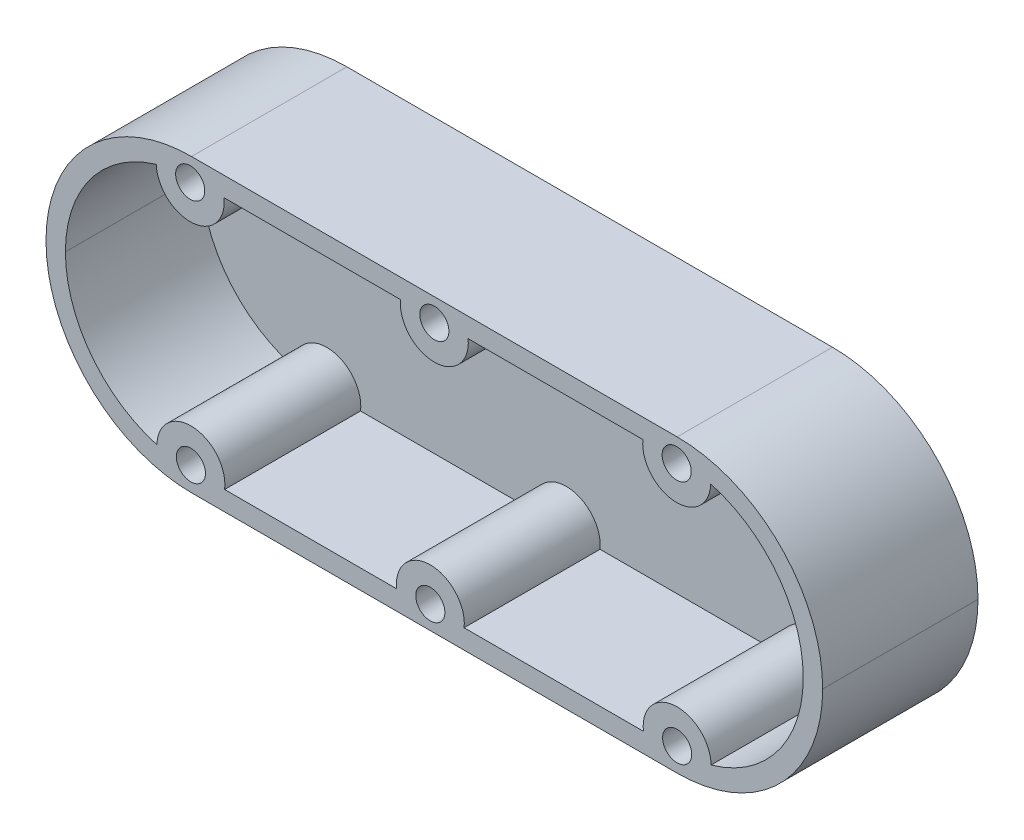
ISO-10303-21;
HEADER;
FILE_DESCRIPTION(('STEP AP214'),'2;1');
FILE_NAME('part.step','',(''),(''),'','','');
FILE_SCHEMA(('AUTOMOTIVE_DESIGN { 1 0 10303 214 1 1 1 1 }'));
ENDSEC;
DATA;
#1=APPLICATION_CONTEXT('core data for automotive mechanical design processes');
#2=APPLICATION_PROTOCOL_DEFINITION('international standard','automotive_design',2000,#1);
#3=PRODUCT_CONTEXT('',#1,'mechanical');
#4=PRODUCT('Part','Part','',(#3));
#5=PRODUCT_RELATED_PRODUCT_CATEGORY('part','',(#4));
#6=PRODUCT_DEFINITION_FORMATION('','',#4);
#7=PRODUCT_DEFINITION_CONTEXT('part definition',#1,'design');
#8=PRODUCT_DEFINITION('design','',#6,#7);
#9=PRODUCT_DEFINITION_SHAPE('','',#8);
#10=(LENGTH_UNIT() NAMED_UNIT(*) SI_UNIT(.MILLI.,.METRE.));
#11=(NAMED_UNIT(*) PLANE_ANGLE_UNIT() SI_UNIT($,.RADIAN.));
#12=(NAMED_UNIT(*) SI_UNIT($,.STERADIAN.) SOLID_ANGLE_UNIT());
#13=UNCERTAINTY_MEASURE_WITH_UNIT(LENGTH_MEASURE(1.E-05),#10,'distance_accuracy_value','');
#14=(GEOMETRIC_REPRESENTATION_CONTEXT(3) GLOBAL_UNCERTAINTY_ASSIGNED_CONTEXT((#13)) GLOBAL_UNIT_ASSIGNED_CONTEXT((#10,
#11,#12)) REPRESENTATION_CONTEXT('',''));
#15=CARTESIAN_POINT('',(0.,0.,0.));
#16=DIRECTION('',(0.,0.,1.));
#17=DIRECTION('',(1.,0.,0.));
#18=AXIS2_PLACEMENT_3D('',#15,#16,#17);
#19=CARTESIAN_POINT('',(-39.3943328182398,-0.784898420662664,16.));
#20=DIRECTION('',(-1.,0.,0.));
#21=DIRECTION('',(0.,0.,1.));
#22=AXIS2_PLACEMENT_3D('',#19,#20,#21);
#23=PLANE('',#22);
#24=DIRECTION('',(0.,1.,0.));
#25=VECTOR('',#24,1.);
#26=CARTESIAN_POINT('',(-39.3943328182398,-0.784898420662664,0.));
#27=LINE('',#26,#25);
#28=CARTESIAN_POINT('',(-39.3943328182398,-0.784898420662661,0.));
#29=VERTEX_POINT('',#28);
#30=CARTESIAN_POINT('',(-39.3943328182398,-0.764898420662635,0.));
#31=VERTEX_POINT('',#30);
#32=EDGE_CURVE('E322',#29,#31,#27,.T.);
#33=ORIENTED_EDGE('',*,*,#32,.F.);
#34=DIRECTION('',(0.,0.,-1.));
#35=VECTOR('',#34,1.);
#36=CARTESIAN_POINT('',(-39.3943328182398,-0.784898420662661,16.));
#37=LINE('',#36,#35);
#38=CARTESIAN_POINT('',(-39.3943328182398,-0.784898420662661,16.));
#39=VERTEX_POINT('',#38);
#40=EDGE_CURVE('E12',#39,#29,#37,.T.);
#41=ORIENTED_EDGE('',*,*,#40,.F.);
#42=DIRECTION('',(0.,1.,0.));
#43=VECTOR('',#42,1.);
#44=CARTESIAN_POINT('',(-39.3943328182398,-0.784898420662664,16.));
#45=LINE('',#44,#43);
#46=CARTESIAN_POINT('',(-39.3943328182398,-0.764898420662635,16.));
#47=VERTEX_POINT('',#46);
#48=EDGE_CURVE('E349',#39,#47,#45,.T.);
#49=ORIENTED_EDGE('',*,*,#48,.T.);
#50=DIRECTION('',(0.,0.,-1.));
#51=VECTOR('',#50,1.);
#52=CARTESIAN_POINT('',(-39.3943328182398,-0.764898420662635,16.));
#53=LINE('',#52,#51);
#54=EDGE_CURVE('E210',#47,#31,#53,.T.);
#55=ORIENTED_EDGE('',*,*,#54,.T.);
#56=EDGE_LOOP('',(#33,#41,#49,#55));
#57=FACE_BOUND('',#56,.T.);
#58=ADVANCED_FACE('F207',(#57),#23,.T.);
#59=CARTESIAN_POINT('',(-24.4043328182398,-0.784898420662636,16.));
#60=DIRECTION('',(0.,0.,-1.));
#61=DIRECTION('',(-1.,0.,0.));
#62=AXIS2_PLACEMENT_3D('',#59,#60,#61);
#63=CYLINDRICAL_SURFACE('',#62,14.99);
#64=CARTESIAN_POINT('',(-24.4043328182398,-0.784898420662636,0.));
#65=DIRECTION('',(0.,0.,1.));
#66=DIRECTION('',(1.,0.,0.));
#67=AXIS2_PLACEMENT_3D('',#64,#65,#66);
#68=CIRCLE('',#67,14.99);
#69=CARTESIAN_POINT('',(-24.4043328182398,-15.7748984206626,0.));
#70=VERTEX_POINT('',#69);
#71=EDGE_CURVE('E347',#29,#70,#68,.T.);
#72=ORIENTED_EDGE('',*,*,#71,.T.);
#73=DIRECTION('',(0.,0.,-1.));
#74=VECTOR('',#73,1.);
#75=CARTESIAN_POINT('',(-24.4043328182398,-15.7748984206626,16.));
#76=LINE('',#75,#74);
#77=CARTESIAN_POINT('',(-24.4043328182398,-15.7748984206626,16.));
#78=VERTEX_POINT('',#77);
#79=EDGE_CURVE('E216',#78,#70,#76,.T.);
#80=ORIENTED_EDGE('',*,*,#79,.F.);
#81=CARTESIAN_POINT('',(-24.4043328182398,-0.784898420662636,16.));
#82=DIRECTION('',(0.,0.,1.));
#83=DIRECTION('',(1.,0.,0.));
#84=AXIS2_PLACEMENT_3D('',#81,#82,#83);
#85=CIRCLE('',#84,14.99);
#86=EDGE_CURVE('E293',#39,#78,#85,.T.);
#87=ORIENTED_EDGE('',*,*,#86,.F.);
#88=ORIENTED_EDGE('',*,*,#40,.T.);
#89=EDGE_LOOP('',(#72,#80,#87,#88));
#90=FACE_BOUND('',#89,.T.);
#91=ADVANCED_FACE('F370',(#90),#63,.T.);
#92=CARTESIAN_POINT('',(-24.4043328182398,-15.7748984206626,16.));
#93=DIRECTION('',(0.,1.,0.));
#94=DIRECTION('',(0.,0.,1.));
#95=AXIS2_PLACEMENT_3D('',#92,#93,#94);
#96=PLANE('',#95);
#97=DIRECTION('',(1.,0.,0.));
#98=VECTOR('',#97,1.);
#99=CARTESIAN_POINT('',(-24.4043328182398,-15.7748984206626,0.));
#100=LINE('',#99,#98);
#101=CARTESIAN_POINT('',(25.6156671817602,-15.7748984206626,0.));
#102=VERTEX_POINT('',#101);
#103=EDGE_CURVE('E303',#70,#102,#100,.T.);
#104=ORIENTED_EDGE('',*,*,#103,.T.);
#105=DIRECTION('',(0.,0.,-1.));
#106=VECTOR('',#105,1.);
#107=CARTESIAN_POINT('',(25.6156671817602,-15.7748984206626,16.));
#108=LINE('',#107,#106);
#109=CARTESIAN_POINT('',(25.6156671817602,-15.7748984206626,16.));
#110=VERTEX_POINT('',#109);
#111=EDGE_CURVE('E300',#110,#102,#108,.T.);
#112=ORIENTED_EDGE('',*,*,#111,.F.);
#113=DIRECTION('',(1.,0.,0.));
#114=VECTOR('',#113,1.);
#115=CARTESIAN_POINT('',(-24.4043328182398,-15.7748984206626,16.));
#116=LINE('',#115,#114);
#117=EDGE_CURVE('E287',#78,#110,#116,.T.);
#118=ORIENTED_EDGE('',*,*,#117,.F.);
#119=ORIENTED_EDGE('',*,*,#79,.T.);
#120=EDGE_LOOP('',(#104,#112,#118,#119));
#121=FACE_BOUND('',#120,.T.);
#122=ADVANCED_FACE('F301',(#121),#96,.F.);
#123=CARTESIAN_POINT('',(25.6156671817602,-0.784898420662636,16.));
#124=DIRECTION('',(0.,0.,-1.));
#125=DIRECTION('',(-1.,0.,0.));
#126=AXIS2_PLACEMENT_3D('',#123,#124,#125);
#127=CYLINDRICAL_SURFACE('',#126,14.99);
#128=CARTESIAN_POINT('',(25.6156671817602,-0.784898420662636,0.));
#129=DIRECTION('',(0.,0.,1.));
#130=DIRECTION('',(1.,0.,0.));
#131=AXIS2_PLACEMENT_3D('',#128,#129,#130);
#132=CIRCLE('',#131,14.99);
#133=CARTESIAN_POINT('',(40.6056671817602,-0.784898420662636,0.));
#134=VERTEX_POINT('',#133);
#135=EDGE_CURVE('E342',#102,#134,#132,.T.);
#136=ORIENTED_EDGE('',*,*,#135,.T.);
#137=DIRECTION('',(0.,0.,-1.));
#138=VECTOR('',#137,1.);
#139=CARTESIAN_POINT('',(40.6056671817602,-0.784898420662636,16.));
#140=LINE('',#139,#138);
#141=CARTESIAN_POINT('',(40.6056671817602,-0.784898420662636,16.));
#142=VERTEX_POINT('',#141);
#143=EDGE_CURVE('E307',#142,#134,#140,.T.);
#144=ORIENTED_EDGE('',*,*,#143,.F.);
#145=CARTESIAN_POINT('',(25.6156671817602,-0.784898420662636,16.));
#146=DIRECTION('',(0.,0.,1.));
#147=DIRECTION('',(1.,0.,0.));
#148=AXIS2_PLACEMENT_3D('',#145,#146,#147);
#149=CIRCLE('',#148,14.99);
#150=EDGE_CURVE('E291',#110,#142,#149,.T.);
#151=ORIENTED_EDGE('',*,*,#150,.F.);
#152=ORIENTED_EDGE('',*,*,#111,.T.);
#153=EDGE_LOOP('',(#136,#144,#151,#152));
#154=FACE_BOUND('',#153,.T.);
#155=ADVANCED_FACE('F309',(#154),#127,.T.);
#156=CARTESIAN_POINT('',(40.6056671817602,-0.784898420662636,16.));
#157=DIRECTION('',(-1.,0.,0.));
#158=DIRECTION('',(0.,0.,1.));
#159=AXIS2_PLACEMENT_3D('',#156,#157,#158);
#160=PLANE('',#159);
#161=DIRECTION('',(0.,1.,0.));
#162=VECTOR('',#161,1.);
#163=CARTESIAN_POINT('',(40.6056671817602,-0.784898420662636,0.));
#164=LINE('',#163,#162);
#165=CARTESIAN_POINT('',(40.6056671817602,-0.764898420662678,0.));
#166=VERTEX_POINT('',#165);
#167=EDGE_CURVE('E339',#134,#166,#164,.T.);
#168=ORIENTED_EDGE('',*,*,#167,.T.);
#169=DIRECTION('',(0.,0.,-1.));
#170=VECTOR('',#169,1.);
#171=CARTESIAN_POINT('',(40.6056671817602,-0.764898420662678,16.));
#172=LINE('',#171,#170);
#173=CARTESIAN_POINT('',(40.6056671817602,-0.764898420662678,16.));
#174=VERTEX_POINT('',#173);
#175=EDGE_CURVE('E355',#174,#166,#172,.T.);
#176=ORIENTED_EDGE('',*,*,#175,.F.);
#177=DIRECTION('',(0.,1.,0.));
#178=VECTOR('',#177,1.);
#179=CARTESIAN_POINT('',(40.6056671817602,-0.784898420662636,16.));
#180=LINE('',#179,#178);
#181=EDGE_CURVE('E313',#142,#174,#180,.T.);
#182=ORIENTED_EDGE('',*,*,#181,.F.);
#183=ORIENTED_EDGE('',*,*,#143,.T.);
#184=EDGE_LOOP('',(#168,#176,#182,#183));
#185=FACE_BOUND('',#184,.T.);
#186=ADVANCED_FACE('F393',(#185),#160,.F.);
#187=CARTESIAN_POINT('',(25.6156671817602,-0.764898420662637,16.));
#188=DIRECTION('',(0.,0.,-1.));
#189=DIRECTION('',(-1.,0.,0.));
#190=AXIS2_PLACEMENT_3D('',#187,#188,#189);
#191=CYLINDRICAL_SURFACE('',#190,14.99);
#192=CARTESIAN_POINT('',(25.6156671817602,-0.764898420662637,0.));
#193=DIRECTION('',(0.,0.,1.));
#194=DIRECTION('',(1.,0.,0.));
#195=AXIS2_PLACEMENT_3D('',#192,#193,#194);
#196=CIRCLE('',#195,14.99);
#197=CARTESIAN_POINT('',(25.6156671817602,14.2251015793374,0.));
#198=VERTEX_POINT('',#197);
#199=EDGE_CURVE('E335',#166,#198,#196,.T.);
#200=ORIENTED_EDGE('',*,*,#199,.T.);
#201=DIRECTION('',(0.,0.,-1.));
#202=VECTOR('',#201,1.);
#203=CARTESIAN_POINT('',(25.6156671817602,14.2251015793374,16.));
#204=LINE('',#203,#202);
#205=CARTESIAN_POINT('',(25.6156671817602,14.2251015793374,16.));
#206=VERTEX_POINT('',#205);
#207=EDGE_CURVE('E359',#206,#198,#204,.T.);
#208=ORIENTED_EDGE('',*,*,#207,.F.);
#209=CARTESIAN_POINT('',(25.6156671817602,-0.764898420662637,16.));
#210=DIRECTION('',(0.,0.,1.));
#211=DIRECTION('',(1.,0.,0.));
#212=AXIS2_PLACEMENT_3D('',#209,#210,#211);
#213=CIRCLE('',#212,14.99);
#214=EDGE_CURVE('E316',#174,#206,#213,.T.);
#215=ORIENTED_EDGE('',*,*,#214,.F.);
#216=ORIENTED_EDGE('',*,*,#175,.T.);
#217=EDGE_LOOP('',(#200,#208,#215,#216));
#218=FACE_BOUND('',#217,.T.);
#219=ADVANCED_FACE('F387',(#218),#191,.T.);
#220=CARTESIAN_POINT('',(-24.4043328182398,14.2251015793373,16.));
#221=DIRECTION('',(0.,1.,0.));
#222=DIRECTION('',(0.,0.,1.));
#223=AXIS2_PLACEMENT_3D('',#220,#221,#222);
#224=PLANE('',#223);
#225=DIRECTION('',(1.,0.,0.));
#226=VECTOR('',#225,1.);
#227=CARTESIAN_POINT('',(-24.4043328182398,14.2251015793373,0.));
#228=LINE('',#227,#226);
#229=CARTESIAN_POINT('',(-24.4043328182398,14.2251015793373,0.));
#230=VERTEX_POINT('',#229);
#231=EDGE_CURVE('E331',#230,#198,#228,.T.);
#232=ORIENTED_EDGE('',*,*,#231,.F.);
#233=DIRECTION('',(0.,0.,-1.));
#234=VECTOR('',#233,1.);
#235=CARTESIAN_POINT('',(-24.4043328182398,14.2251015793373,16.));
#236=LINE('',#235,#234);
#237=CARTESIAN_POINT('',(-24.4043328182398,14.2251015793373,16.));
#238=VERTEX_POINT('',#237);
#239=EDGE_CURVE('E361',#238,#230,#236,.T.);
#240=ORIENTED_EDGE('',*,*,#239,.F.);
#241=DIRECTION('',(1.,0.,0.));
#242=VECTOR('',#241,1.);
#243=CARTESIAN_POINT('',(-24.4043328182398,14.2251015793373,16.));
#244=LINE('',#243,#242);
#245=EDGE_CURVE('E374',#238,#206,#244,.T.);
#246=ORIENTED_EDGE('',*,*,#245,.T.);
#247=ORIENTED_EDGE('',*,*,#207,.T.);
#248=EDGE_LOOP('',(#232,#240,#246,#247));
#249=FACE_BOUND('',#248,.T.);
#250=ADVANCED_FACE('F390',(#249),#224,.T.);
#251=CARTESIAN_POINT('',(-24.4043328182398,-0.764898420662637,16.));
#252=DIRECTION('',(0.,0.,-1.));
#253=DIRECTION('',(-1.,0.,0.));
#254=AXIS2_PLACEMENT_3D('',#251,#252,#253);
#255=CYLINDRICAL_SURFACE('',#254,14.99);
#256=CARTESIAN_POINT('',(-24.4043328182398,-0.764898420662637,0.));
#257=DIRECTION('',(0.,0.,1.));
#258=DIRECTION('',(1.,0.,0.));
#259=AXIS2_PLACEMENT_3D('',#256,#257,#258);
#260=CIRCLE('',#259,14.99);
#261=EDGE_CURVE('E326',#230,#31,#260,.T.);
#262=ORIENTED_EDGE('',*,*,#261,.T.);
#263=ORIENTED_EDGE('',*,*,#54,.F.);
#264=CARTESIAN_POINT('',(-24.4043328182398,-0.764898420662637,16.));
#265=DIRECTION('',(0.,0.,1.));
#266=DIRECTION('',(1.,0.,0.));
#267=AXIS2_PLACEMENT_3D('',#264,#265,#266);
#268=CIRCLE('',#267,14.99);
#269=EDGE_CURVE('E270',#238,#47,#268,.T.);
#270=ORIENTED_EDGE('',*,*,#269,.F.);
#271=ORIENTED_EDGE('',*,*,#239,.T.);
#272=EDGE_LOOP('',(#262,#263,#270,#271));
#273=FACE_BOUND('',#272,.T.);
#274=ADVANCED_FACE('F366',(#273),#255,.T.);
#275=CARTESIAN_POINT('',(-24.4043328182398,-0.764898420662637,16.));
#276=DIRECTION('',(0.,0.,1.));
#277=DIRECTION('',(1.,0.,0.));
#278=AXIS2_PLACEMENT_3D('',#275,#276,#277);
#279=PLANE('',#278);
#280=CARTESIAN_POINT('',(-24.541760818845,11.8402259668656,16.));
#281=DIRECTION('',(0.,0.,1.));
#282=DIRECTION('',(1.,0.,0.));
#283=AXIS2_PLACEMENT_3D('',#280,#281,#282);
#284=CIRCLE('',#283,3.5);
#285=CARTESIAN_POINT('',(-21.0629864997888,12.2251015793373,16.));
#286=VERTEX_POINT('',#285);
#287=CARTESIAN_POINT('',(-28.0391931177078,11.7061837538462,16.));
#288=VERTEX_POINT('',#287);
#289=EDGE_CURVE('E526',#286,#288,#284,.F.);
#290=ORIENTED_EDGE('',*,*,#289,.F.);
#291=DIRECTION('',(1.,0.,0.));
#292=VECTOR('',#291,1.);
#293=CARTESIAN_POINT('',(-24.4043328182398,12.2251015793373,16.));
#294=LINE('',#293,#292);
#295=CARTESIAN_POINT('',(-2.87787039640487,12.2251015793373,16.));
#296=VERTEX_POINT('',#295);
#297=EDGE_CURVE('E626',#286,#296,#294,.T.);
#298=ORIENTED_EDGE('',*,*,#297,.T.);
#299=CARTESIAN_POINT('',(0.605667181760181,11.8860353004006,16.));
#300=DIRECTION('',(0.,0.,1.));
#301=DIRECTION('',(1.,0.,0.));
#302=AXIS2_PLACEMENT_3D('',#299,#300,#301);
#303=CIRCLE('',#302,3.5);
#304=CARTESIAN_POINT('',(4.08920475992523,12.2251015793373,16.));
#305=VERTEX_POINT('',#304);
#306=EDGE_CURVE('E599',#305,#296,#303,.F.);
#307=ORIENTED_EDGE('',*,*,#306,.F.);
#308=CARTESIAN_POINT('',(22.0910835291689,12.2251015793373,16.));
#309=VERTEX_POINT('',#308);
#310=EDGE_CURVE('E224',#305,#309,#294,.T.);
#311=ORIENTED_EDGE('',*,*,#310,.T.);
#312=CARTESIAN_POINT('',(25.569857848225,11.8402259668656,16.));
#313=DIRECTION('',(0.,0.,1.));
#314=DIRECTION('',(1.,0.,0.));
#315=AXIS2_PLACEMENT_3D('',#312,#313,#314);
#316=CIRCLE('',#315,3.5);
#317=CARTESIAN_POINT('',(29.0688847017164,11.7576967081382,16.));
#318=VERTEX_POINT('',#317);
#319=EDGE_CURVE('E594',#318,#309,#316,.F.);
#320=ORIENTED_EDGE('',*,*,#319,.F.);
#321=CARTESIAN_POINT('',(25.6156671817602,-0.764898420662637,16.));
#322=DIRECTION('',(0.,0.,1.));
#323=DIRECTION('',(1.,0.,0.));
#324=AXIS2_PLACEMENT_3D('',#321,#322,#323);
#325=CIRCLE('',#324,12.99);
#326=CARTESIAN_POINT('',(38.6056671817602,-0.764898420662678,16.));
#327=VERTEX_POINT('',#326);
#328=EDGE_CURVE('E622',#327,#318,#325,.T.);
#329=ORIENTED_EDGE('',*,*,#328,.F.);
#330=DIRECTION('',(0.,1.,0.));
#331=VECTOR('',#330,1.);
#332=CARTESIAN_POINT('',(38.6056671817602,-0.784898420662636,16.));
#333=LINE('',#332,#331);
#334=CARTESIAN_POINT('',(38.6056671817602,-0.784898420662634,16.));
#335=VERTEX_POINT('',#334);
#336=EDGE_CURVE('E618',#335,#327,#333,.T.);
#337=ORIENTED_EDGE('',*,*,#336,.F.);
#338=CARTESIAN_POINT('',(25.6156671817602,-0.784898420662636,16.));
#339=DIRECTION('',(0.,0.,1.));
#340=DIRECTION('',(1.,0.,0.));
#341=AXIS2_PLACEMENT_3D('',#338,#339,#340);
#342=CIRCLE('',#341,12.99);
#343=CARTESIAN_POINT('',(29.1151483290156,-13.2946438896961,16.));
#344=VERTEX_POINT('',#343);
#345=EDGE_CURVE('E614',#344,#335,#342,.T.);
#346=ORIENTED_EDGE('',*,*,#345,.F.);
#347=CARTESIAN_POINT('',(25.6156671817601,-13.3549074774017,16.));
#348=DIRECTION('',(0.,0.,1.));
#349=DIRECTION('',(1.,0.,0.));
#350=AXIS2_PLACEMENT_3D('',#347,#348,#349);
#351=CIRCLE('',#350,3.5);
#352=CARTESIAN_POINT('',(22.1409574661754,-13.7748984206626,16.));
#353=VERTEX_POINT('',#352);
#354=EDGE_CURVE('E589',#353,#344,#351,.F.);
#355=ORIENTED_EDGE('',*,*,#354,.F.);
#356=DIRECTION('',(1.,0.,0.));
#357=VECTOR('',#356,1.);
#358=CARTESIAN_POINT('',(-24.4043328182398,-13.7748984206626,16.));
#359=LINE('',#358,#357);
#360=CARTESIAN_POINT('',(3.67332400170364,-13.7748984206626,16.));
#361=VERTEX_POINT('',#360);
#362=EDGE_CURVE('E610',#361,#353,#359,.T.);
#363=ORIENTED_EDGE('',*,*,#362,.F.);
#364=CARTESIAN_POINT('',(0.193383179944898,-13.4007168109367,16.));
#365=DIRECTION('',(0.,0.,1.));
#366=DIRECTION('',(1.,0.,0.));
#367=AXIS2_PLACEMENT_3D('',#364,#365,#366);
#368=CIRCLE('',#367,3.5);
#369=CARTESIAN_POINT('',(-3.28655764181385,-13.7748984206626,16.));
#370=VERTEX_POINT('',#369);
#371=EDGE_CURVE('E584',#370,#361,#368,.F.);
#372=ORIENTED_EDGE('',*,*,#371,.F.);
#373=CARTESIAN_POINT('',(-20.9961702521569,-13.7748984206626,16.));
#374=VERTEX_POINT('',#373);
#375=EDGE_CURVE('E609',#374,#370,#359,.T.);
#376=ORIENTED_EDGE('',*,*,#375,.F.);
#377=CARTESIAN_POINT('',(-24.4681185007644,-13.3326593914132,16.));
#378=DIRECTION('',(0.,0.,1.));
#379=DIRECTION('',(1.,0.,0.));
#380=AXIS2_PLACEMENT_3D('',#377,#378,#379);
#381=CIRCLE('',#380,3.5);
#382=CARTESIAN_POINT('',(-27.967669599828,-13.2766049086082,16.));
#383=VERTEX_POINT('',#382);
#384=EDGE_CURVE('E579',#383,#374,#381,.F.);
#385=ORIENTED_EDGE('',*,*,#384,.F.);
#386=CARTESIAN_POINT('',(-24.4043328182398,-0.784898420662636,16.));
#387=DIRECTION('',(0.,0.,1.));
#388=DIRECTION('',(1.,0.,0.));
#389=AXIS2_PLACEMENT_3D('',#386,#387,#388);
#390=CIRCLE('',#389,12.99);
#391=CARTESIAN_POINT('',(-37.3943328182398,-0.784898420662661,16.));
#392=VERTEX_POINT('',#391);
#393=EDGE_CURVE('E543',#392,#383,#390,.T.);
#394=ORIENTED_EDGE('',*,*,#393,.F.);
#395=DIRECTION('',(0.,1.,0.));
#396=VECTOR('',#395,1.);
#397=CARTESIAN_POINT('',(-37.3943328182398,-0.784898420662664,16.));
#398=LINE('',#397,#396);
#399=CARTESIAN_POINT('',(-37.3943328182398,-0.764898420662635,16.));
#400=VERTEX_POINT('',#399);
#401=EDGE_CURVE('E547',#392,#400,#398,.T.);
#402=ORIENTED_EDGE('',*,*,#401,.T.);
#403=CARTESIAN_POINT('',(-24.4043328182398,-0.764898420662637,16.));
#404=DIRECTION('',(0.,0.,1.));
#405=DIRECTION('',(1.,0.,0.));
#406=AXIS2_PLACEMENT_3D('',#403,#404,#405);
#407=CIRCLE('',#406,12.99);
#408=EDGE_CURVE('E605',#288,#400,#407,.T.);
#409=ORIENTED_EDGE('',*,*,#408,.F.);
#410=EDGE_LOOP('',(#290,#298,#307,#311,#320,#329,#337,#346,#355,#363,#372,#376,#385,#394,#402,#409));
#411=FACE_BOUND('',#410,.T.);
#412=CARTESIAN_POINT('',(-24.4681185007644,-13.3326593914132,16.));
#413=DIRECTION('',(0.,0.,-1.));
#414=DIRECTION('',(-1.,0.,0.));
#415=AXIS2_PLACEMENT_3D('',#412,#413,#414);
#416=CIRCLE('',#415,1.5);
#417=CARTESIAN_POINT('',(-25.9681185007644,-13.3326593914132,16.));
#418=VERTEX_POINT('',#417);
#419=EDGE_CURVE('E694',#418,#418,#416,.T.);
#420=ORIENTED_EDGE('',*,*,#419,.T.);
#421=EDGE_LOOP('',(#420));
#422=FACE_BOUND('',#421,.T.);
#423=CARTESIAN_POINT('',(0.193383179944898,-13.4007168109367,16.));
#424=DIRECTION('',(0.,0.,-1.));
#425=DIRECTION('',(-1.,0.,0.));
#426=AXIS2_PLACEMENT_3D('',#423,#424,#425);
#427=CIRCLE('',#426,1.5);
#428=CARTESIAN_POINT('',(-1.3066168200551,-13.4007168109367,16.));
#429=VERTEX_POINT('',#428);
#430=EDGE_CURVE('E702',#429,#429,#427,.T.);
#431=ORIENTED_EDGE('',*,*,#430,.T.);
#432=EDGE_LOOP('',(#431));
#433=FACE_BOUND('',#432,.T.);
#434=CARTESIAN_POINT('',(25.6156671817601,-13.3549074774017,16.));
#435=DIRECTION('',(0.,0.,-1.));
#436=DIRECTION('',(-1.,0.,0.));
#437=AXIS2_PLACEMENT_3D('',#434,#435,#436);
#438=CIRCLE('',#437,1.5);
#439=CARTESIAN_POINT('',(24.1156671817601,-13.3549074774017,16.));
#440=VERTEX_POINT('',#439);
#441=EDGE_CURVE('E710',#440,#440,#438,.T.);
#442=ORIENTED_EDGE('',*,*,#441,.T.);
#443=EDGE_LOOP('',(#442));
#444=FACE_BOUND('',#443,.T.);
#445=CARTESIAN_POINT('',(25.569857848225,11.8402259668656,16.));
#446=DIRECTION('',(0.,0.,-1.));
#447=DIRECTION('',(-1.,0.,0.));
#448=AXIS2_PLACEMENT_3D('',#445,#446,#447);
#449=CIRCLE('',#448,1.5);
#450=CARTESIAN_POINT('',(24.069857848225,11.8402259668656,16.));
#451=VERTEX_POINT('',#450);
#452=EDGE_CURVE('E718',#451,#451,#449,.T.);
#453=ORIENTED_EDGE('',*,*,#452,.T.);
#454=EDGE_LOOP('',(#453));
#455=FACE_BOUND('',#454,.T.);
#456=CARTESIAN_POINT('',(0.605667181760181,11.8860353004006,16.));
#457=DIRECTION('',(0.,0.,-1.));
#458=DIRECTION('',(-1.,0.,0.));
#459=AXIS2_PLACEMENT_3D('',#456,#457,#458);
#460=CIRCLE('',#459,1.5);
#461=CARTESIAN_POINT('',(-0.894332818239822,11.8860353004006,16.));
#462=VERTEX_POINT('',#461);
#463=EDGE_CURVE('E726',#462,#462,#460,.T.);
#464=ORIENTED_EDGE('',*,*,#463,.T.);
#465=EDGE_LOOP('',(#464));
#466=FACE_BOUND('',#465,.T.);
#467=CARTESIAN_POINT('',(-24.541760818845,11.8402259668656,16.));
#468=DIRECTION('',(0.,0.,-1.));
#469=DIRECTION('',(-1.,0.,0.));
#470=AXIS2_PLACEMENT_3D('',#467,#468,#469);
#471=CIRCLE('',#470,1.5);
#472=CARTESIAN_POINT('',(-26.041760818845,11.8402259668656,16.));
#473=VERTEX_POINT('',#472);
#474=EDGE_CURVE('E327',#473,#473,#471,.T.);
#475=ORIENTED_EDGE('',*,*,#474,.T.);
#476=EDGE_LOOP('',(#475));
#477=FACE_BOUND('',#476,.T.);
#478=ORIENTED_EDGE('',*,*,#48,.F.);
#479=ORIENTED_EDGE('',*,*,#86,.T.);
#480=ORIENTED_EDGE('',*,*,#117,.T.);
#481=ORIENTED_EDGE('',*,*,#150,.T.);
#482=ORIENTED_EDGE('',*,*,#181,.T.);
#483=ORIENTED_EDGE('',*,*,#214,.T.);
#484=ORIENTED_EDGE('',*,*,#245,.F.);
#485=ORIENTED_EDGE('',*,*,#269,.T.);
#486=EDGE_LOOP('',(#478,#479,#480,#481,#482,#483,#484,#485));
#487=FACE_BOUND('',#486,.T.);
#488=ADVANCED_FACE('F289',(#411,#422,#433,#444,#455,#466,#477,#487),#279,.T.);
#489=CARTESIAN_POINT('',(-24.4043328182398,-0.764898420662637,0.));
#490=DIRECTION('',(0.,0.,1.));
#491=DIRECTION('',(1.,0.,0.));
#492=AXIS2_PLACEMENT_3D('',#489,#490,#491);
#493=PLANE('',#492);
#494=CARTESIAN_POINT('',(-24.4681185007644,-13.3326593914132,0.));
#495=DIRECTION('',(0.,0.,-1.));
#496=DIRECTION('',(-1.,0.,0.));
#497=AXIS2_PLACEMENT_3D('',#494,#495,#496);
#498=CIRCLE('',#497,1.5);
#499=CARTESIAN_POINT('',(-25.9681185007644,-13.3326593914132,0.));
#500=VERTEX_POINT('',#499);
#501=EDGE_CURVE('E693',#500,#500,#498,.T.);
#502=ORIENTED_EDGE('',*,*,#501,.F.);
#503=EDGE_LOOP('',(#502));
#504=FACE_BOUND('',#503,.T.);
#505=CARTESIAN_POINT('',(0.193383179944898,-13.4007168109367,0.));
#506=DIRECTION('',(0.,0.,-1.));
#507=DIRECTION('',(-1.,0.,0.));
#508=AXIS2_PLACEMENT_3D('',#505,#506,#507);
#509=CIRCLE('',#508,1.5);
#510=CARTESIAN_POINT('',(-1.3066168200551,-13.4007168109367,0.));
#511=VERTEX_POINT('',#510);
#512=EDGE_CURVE('E698',#511,#511,#509,.T.);
#513=ORIENTED_EDGE('',*,*,#512,.F.);
#514=EDGE_LOOP('',(#513));
#515=FACE_BOUND('',#514,.T.);
#516=CARTESIAN_POINT('',(25.6156671817601,-13.3549074774017,0.));
#517=DIRECTION('',(0.,0.,-1.));
#518=DIRECTION('',(-1.,0.,0.));
#519=AXIS2_PLACEMENT_3D('',#516,#517,#518);
#520=CIRCLE('',#519,1.5);
#521=CARTESIAN_POINT('',(24.1156671817601,-13.3549074774017,0.));
#522=VERTEX_POINT('',#521);
#523=EDGE_CURVE('E706',#522,#522,#520,.T.);
#524=ORIENTED_EDGE('',*,*,#523,.F.);
#525=EDGE_LOOP('',(#524));
#526=FACE_BOUND('',#525,.T.);
#527=CARTESIAN_POINT('',(25.569857848225,11.8402259668656,0.));
#528=DIRECTION('',(0.,0.,-1.));
#529=DIRECTION('',(-1.,0.,0.));
#530=AXIS2_PLACEMENT_3D('',#527,#528,#529);
#531=CIRCLE('',#530,1.5);
#532=CARTESIAN_POINT('',(24.069857848225,11.8402259668656,0.));
#533=VERTEX_POINT('',#532);
#534=EDGE_CURVE('E714',#533,#533,#531,.T.);
#535=ORIENTED_EDGE('',*,*,#534,.F.);
#536=EDGE_LOOP('',(#535));
#537=FACE_BOUND('',#536,.T.);
#538=CARTESIAN_POINT('',(0.605667181760181,11.8860353004006,0.));
#539=DIRECTION('',(0.,0.,-1.));
#540=DIRECTION('',(-1.,0.,0.));
#541=AXIS2_PLACEMENT_3D('',#538,#539,#540);
#542=CIRCLE('',#541,1.5);
#543=CARTESIAN_POINT('',(-0.894332818239822,11.8860353004006,0.));
#544=VERTEX_POINT('',#543);
#545=EDGE_CURVE('E722',#544,#544,#542,.T.);
#546=ORIENTED_EDGE('',*,*,#545,.F.);
#547=EDGE_LOOP('',(#546));
#548=FACE_BOUND('',#547,.T.);
#549=CARTESIAN_POINT('',(-24.541760818845,11.8402259668656,0.));
#550=DIRECTION('',(0.,0.,-1.));
#551=DIRECTION('',(-1.,0.,0.));
#552=AXIS2_PLACEMENT_3D('',#549,#550,#551);
#553=CIRCLE('',#552,1.5);
#554=CARTESIAN_POINT('',(-26.041760818845,11.8402259668656,0.));
#555=VERTEX_POINT('',#554);
#556=EDGE_CURVE('E377',#555,#555,#553,.T.);
#557=ORIENTED_EDGE('',*,*,#556,.F.);
#558=EDGE_LOOP('',(#557));
#559=FACE_BOUND('',#558,.T.);
#560=ORIENTED_EDGE('',*,*,#32,.T.);
#561=ORIENTED_EDGE('',*,*,#261,.F.);
#562=ORIENTED_EDGE('',*,*,#231,.T.);
#563=ORIENTED_EDGE('',*,*,#199,.F.);
#564=ORIENTED_EDGE('',*,*,#167,.F.);
#565=ORIENTED_EDGE('',*,*,#135,.F.);
#566=ORIENTED_EDGE('',*,*,#103,.F.);
#567=ORIENTED_EDGE('',*,*,#71,.F.);
#568=EDGE_LOOP('',(#560,#561,#562,#563,#564,#565,#566,#567));
#569=FACE_BOUND('',#568,.T.);
#570=ADVANCED_FACE('F369',(#504,#515,#526,#537,#548,#559,#569),#493,.F.);
#571=CARTESIAN_POINT('',(-24.541760818845,11.8402259668656,16.));
#572=DIRECTION('',(0.,0.,-1.));
#573=DIRECTION('',(-1.,0.,0.));
#574=AXIS2_PLACEMENT_3D('',#571,#572,#573);
#575=CYLINDRICAL_SURFACE('',#574,1.5);
#576=ORIENTED_EDGE('',*,*,#474,.F.);
#577=EDGE_LOOP('',(#576));
#578=FACE_BOUND('',#577,.T.);
#579=ORIENTED_EDGE('',*,*,#556,.T.);
#580=EDGE_LOOP('',(#579));
#581=FACE_BOUND('',#580,.T.);
#582=ADVANCED_FACE('F414',(#578,#581),#575,.F.);
#583=CARTESIAN_POINT('',(0.605667181760181,11.8860353004006,16.));
#584=DIRECTION('',(0.,0.,-1.));
#585=DIRECTION('',(-1.,0.,0.));
#586=AXIS2_PLACEMENT_3D('',#583,#584,#585);
#587=CYLINDRICAL_SURFACE('',#586,1.5);
#588=ORIENTED_EDGE('',*,*,#463,.F.);
#589=EDGE_LOOP('',(#588));
#590=FACE_BOUND('',#589,.T.);
#591=ORIENTED_EDGE('',*,*,#545,.T.);
#592=EDGE_LOOP('',(#591));
#593=FACE_BOUND('',#592,.T.);
#594=ADVANCED_FACE('F421',(#590,#593),#587,.F.);
#595=CARTESIAN_POINT('',(25.569857848225,11.8402259668656,16.));
#596=DIRECTION('',(0.,0.,-1.));
#597=DIRECTION('',(-1.,0.,0.));
#598=AXIS2_PLACEMENT_3D('',#595,#596,#597);
#599=CYLINDRICAL_SURFACE('',#598,1.5);
#600=ORIENTED_EDGE('',*,*,#452,.F.);
#601=EDGE_LOOP('',(#600));
#602=FACE_BOUND('',#601,.T.);
#603=ORIENTED_EDGE('',*,*,#534,.T.);
#604=EDGE_LOOP('',(#603));
#605=FACE_BOUND('',#604,.T.);
#606=ADVANCED_FACE('F425',(#602,#605),#599,.F.);
#607=CARTESIAN_POINT('',(25.6156671817601,-13.3549074774017,16.));
#608=DIRECTION('',(0.,0.,-1.));
#609=DIRECTION('',(-1.,0.,0.));
#610=AXIS2_PLACEMENT_3D('',#607,#608,#609);
#611=CYLINDRICAL_SURFACE('',#610,1.5);
#612=ORIENTED_EDGE('',*,*,#441,.F.);
#613=EDGE_LOOP('',(#612));
#614=FACE_BOUND('',#613,.T.);
#615=ORIENTED_EDGE('',*,*,#523,.T.);
#616=EDGE_LOOP('',(#615));
#617=FACE_BOUND('',#616,.T.);
#618=ADVANCED_FACE('F429',(#614,#617),#611,.F.);
#619=CARTESIAN_POINT('',(0.193383179944898,-13.4007168109367,16.));
#620=DIRECTION('',(0.,0.,-1.));
#621=DIRECTION('',(-1.,0.,0.));
#622=AXIS2_PLACEMENT_3D('',#619,#620,#621);
#623=CYLINDRICAL_SURFACE('',#622,1.5);
#624=ORIENTED_EDGE('',*,*,#430,.F.);
#625=EDGE_LOOP('',(#624));
#626=FACE_BOUND('',#625,.T.);
#627=ORIENTED_EDGE('',*,*,#512,.T.);
#628=EDGE_LOOP('',(#627));
#629=FACE_BOUND('',#628,.T.);
#630=ADVANCED_FACE('F433',(#626,#629),#623,.F.);
#631=CARTESIAN_POINT('',(-24.4681185007644,-13.3326593914132,16.));
#632=DIRECTION('',(0.,0.,-1.));
#633=DIRECTION('',(-1.,0.,0.));
#634=AXIS2_PLACEMENT_3D('',#631,#632,#633);
#635=CYLINDRICAL_SURFACE('',#634,1.5);
#636=ORIENTED_EDGE('',*,*,#419,.F.);
#637=EDGE_LOOP('',(#636));
#638=FACE_BOUND('',#637,.T.);
#639=ORIENTED_EDGE('',*,*,#501,.T.);
#640=EDGE_LOOP('',(#639));
#641=FACE_BOUND('',#640,.T.);
#642=ADVANCED_FACE('F437',(#638,#641),#635,.F.);
#643=CARTESIAN_POINT('',(-24.4043328182398,-13.7748984206626,16.));
#644=DIRECTION('',(0.,1.,0.));
#645=DIRECTION('',(0.,0.,1.));
#646=AXIS2_PLACEMENT_3D('',#643,#644,#645);
#647=PLANE('',#646);
#648=ORIENTED_EDGE('',*,*,#375,.T.);
#649=DIRECTION('',(0.,0.,-1.));
#650=VECTOR('',#649,1.);
#651=CARTESIAN_POINT('',(-3.28655764181385,-13.7748984206626,16.));
#652=LINE('',#651,#650);
#653=CARTESIAN_POINT('',(-3.28655764181385,-13.7748984206626,2.));
#654=VERTEX_POINT('',#653);
#655=EDGE_CURVE('E681',#370,#654,#652,.T.);
#656=ORIENTED_EDGE('',*,*,#655,.T.);
#657=DIRECTION('',(1.,0.,0.));
#658=VECTOR('',#657,1.);
#659=CARTESIAN_POINT('',(-24.4043328182398,-13.7748984206626,2.));
#660=LINE('',#659,#658);
#661=CARTESIAN_POINT('',(-20.9961702521569,-13.7748984206626,2.));
#662=VERTEX_POINT('',#661);
#663=EDGE_CURVE('E552',#662,#654,#660,.T.);
#664=ORIENTED_EDGE('',*,*,#663,.F.);
#665=DIRECTION('',(0.,0.,-1.));
#666=VECTOR('',#665,1.);
#667=CARTESIAN_POINT('',(-20.9961702521569,-13.7748984206626,16.));
#668=LINE('',#667,#666);
#669=EDGE_CURVE('E689',#374,#662,#668,.T.);
#670=ORIENTED_EDGE('',*,*,#669,.F.);
#671=EDGE_LOOP('',(#648,#656,#664,#670));
#672=FACE_BOUND('',#671,.T.);
#673=ADVANCED_FACE('F441',(#672),#647,.T.);
#674=CARTESIAN_POINT('',(-24.4043328182398,12.2251015793373,16.));
#675=DIRECTION('',(0.,1.,0.));
#676=DIRECTION('',(0.,0.,1.));
#677=AXIS2_PLACEMENT_3D('',#674,#675,#676);
#678=PLANE('',#677);
#679=DIRECTION('',(0.,0.,-1.));
#680=VECTOR('',#679,1.);
#681=CARTESIAN_POINT('',(-2.87787039640487,12.2251015793373,16.));
#682=LINE('',#681,#680);
#683=CARTESIAN_POINT('',(-2.87787039640487,12.2251015793373,2.));
#684=VERTEX_POINT('',#683);
#685=EDGE_CURVE('E658',#684,#296,#682,.F.);
#686=ORIENTED_EDGE('',*,*,#685,.T.);
#687=ORIENTED_EDGE('',*,*,#297,.F.);
#688=DIRECTION('',(0.,0.,-1.));
#689=VECTOR('',#688,1.);
#690=CARTESIAN_POINT('',(-21.0629864997888,12.2251015793373,16.));
#691=LINE('',#690,#689);
#692=CARTESIAN_POINT('',(-21.0629864997888,12.2251015793373,2.));
#693=VERTEX_POINT('',#692);
#694=EDGE_CURVE('E538',#693,#286,#691,.F.);
#695=ORIENTED_EDGE('',*,*,#694,.F.);
#696=DIRECTION('',(1.,0.,0.));
#697=VECTOR('',#696,1.);
#698=CARTESIAN_POINT('',(-24.4043328182398,12.2251015793373,2.));
#699=LINE('',#698,#697);
#700=EDGE_CURVE('E571',#693,#684,#699,.T.);
#701=ORIENTED_EDGE('',*,*,#700,.T.);
#702=EDGE_LOOP('',(#686,#687,#695,#701));
#703=FACE_BOUND('',#702,.T.);
#704=ADVANCED_FACE('F479',(#703),#678,.F.);
#705=CARTESIAN_POINT('',(-37.3943328182398,-0.784898420662664,16.));
#706=DIRECTION('',(-1.,0.,0.));
#707=DIRECTION('',(0.,0.,1.));
#708=AXIS2_PLACEMENT_3D('',#705,#706,#707);
#709=PLANE('',#708);
#710=DIRECTION('',(0.,1.,0.));
#711=VECTOR('',#710,1.);
#712=CARTESIAN_POINT('',(-37.3943328182398,-0.784898420662664,2.));
#713=LINE('',#712,#711);
#714=CARTESIAN_POINT('',(-37.3943328182398,-0.784898420662659,2.));
#715=VERTEX_POINT('',#714);
#716=CARTESIAN_POINT('',(-37.3943328182398,-0.764898420662635,2.));
#717=VERTEX_POINT('',#716);
#718=EDGE_CURVE('E511',#715,#717,#713,.T.);
#719=ORIENTED_EDGE('',*,*,#718,.T.);
#720=DIRECTION('',(0.,0.,1.));
#721=VECTOR('',#720,1.);
#722=CARTESIAN_POINT('',(-37.3943328182398,-0.764898420662635,16.));
#723=LINE('',#722,#721);
#724=EDGE_CURVE('E515',#400,#717,#723,.F.);
#725=ORIENTED_EDGE('',*,*,#724,.F.);
#726=ORIENTED_EDGE('',*,*,#401,.F.);
#727=DIRECTION('',(0.,0.,-1.));
#728=VECTOR('',#727,1.);
#729=CARTESIAN_POINT('',(-37.3943328182398,-0.784898420662659,16.));
#730=LINE('',#729,#728);
#731=EDGE_CURVE('E519',#392,#715,#730,.T.);
#732=ORIENTED_EDGE('',*,*,#731,.T.);
#733=EDGE_LOOP('',(#719,#725,#726,#732));
#734=FACE_BOUND('',#733,.T.);
#735=ADVANCED_FACE('F498',(#734),#709,.F.);
#736=CARTESIAN_POINT('',(-24.4043328182398,-0.784898420662636,16.));
#737=DIRECTION('',(0.,0.,-1.));
#738=DIRECTION('',(-1.,0.,0.));
#739=AXIS2_PLACEMENT_3D('',#736,#737,#738);
#740=CYLINDRICAL_SURFACE('',#739,12.99);
#741=DIRECTION('',(0.,0.,1.));
#742=VECTOR('',#741,1.);
#743=CARTESIAN_POINT('',(-27.967669599828,-13.2766049086082,16.));
#744=LINE('',#743,#742);
#745=CARTESIAN_POINT('',(-27.967669599828,-13.2766049086082,2.));
#746=VERTEX_POINT('',#745);
#747=EDGE_CURVE('E685',#383,#746,#744,.F.);
#748=ORIENTED_EDGE('',*,*,#747,.T.);
#749=CARTESIAN_POINT('',(-24.4043328182398,-0.784898420662636,2.));
#750=DIRECTION('',(0.,0.,1.));
#751=DIRECTION('',(1.,0.,0.));
#752=AXIS2_PLACEMENT_3D('',#749,#750,#751);
#753=CIRCLE('',#752,12.99);
#754=EDGE_CURVE('E544',#715,#746,#753,.T.);
#755=ORIENTED_EDGE('',*,*,#754,.F.);
#756=ORIENTED_EDGE('',*,*,#731,.F.);
#757=ORIENTED_EDGE('',*,*,#393,.T.);
#758=EDGE_LOOP('',(#748,#755,#756,#757));
#759=FACE_BOUND('',#758,.T.);
#760=ADVANCED_FACE('F494',(#759),#740,.F.);
#761=ORIENTED_EDGE('',*,*,#362,.T.);
#762=DIRECTION('',(0.,0.,-1.));
#763=VECTOR('',#762,1.);
#764=CARTESIAN_POINT('',(22.1409574661754,-13.7748984206626,16.));
#765=LINE('',#764,#763);
#766=CARTESIAN_POINT('',(22.1409574661754,-13.7748984206626,2.));
#767=VERTEX_POINT('',#766);
#768=EDGE_CURVE('E669',#353,#767,#765,.T.);
#769=ORIENTED_EDGE('',*,*,#768,.T.);
#770=CARTESIAN_POINT('',(3.67332400170364,-13.7748984206626,2.));
#771=VERTEX_POINT('',#770);
#772=EDGE_CURVE('E548',#771,#767,#660,.T.);
#773=ORIENTED_EDGE('',*,*,#772,.F.);
#774=DIRECTION('',(0.,0.,-1.));
#775=VECTOR('',#774,1.);
#776=CARTESIAN_POINT('',(3.67332400170364,-13.7748984206626,16.));
#777=LINE('',#776,#775);
#778=EDGE_CURVE('E677',#361,#771,#777,.T.);
#779=ORIENTED_EDGE('',*,*,#778,.F.);
#780=EDGE_LOOP('',(#761,#769,#773,#779));
#781=FACE_BOUND('',#780,.T.);
#782=ADVANCED_FACE('F490',(#781),#647,.T.);
#783=CARTESIAN_POINT('',(25.6156671817602,-0.784898420662636,16.));
#784=DIRECTION('',(0.,0.,-1.));
#785=DIRECTION('',(-1.,0.,0.));
#786=AXIS2_PLACEMENT_3D('',#783,#784,#785);
#787=CYLINDRICAL_SURFACE('',#786,12.99);
#788=ORIENTED_EDGE('',*,*,#345,.T.);
#789=DIRECTION('',(0.,0.,1.));
#790=VECTOR('',#789,1.);
#791=CARTESIAN_POINT('',(38.6056671817602,-0.784898420662636,16.));
#792=LINE('',#791,#790);
#793=CARTESIAN_POINT('',(38.6056671817602,-0.784898420662636,2.));
#794=VERTEX_POINT('',#793);
#795=EDGE_CURVE('E539',#335,#794,#792,.F.);
#796=ORIENTED_EDGE('',*,*,#795,.T.);
#797=CARTESIAN_POINT('',(25.6156671817602,-0.784898420662636,2.));
#798=DIRECTION('',(0.,0.,1.));
#799=DIRECTION('',(1.,0.,0.));
#800=AXIS2_PLACEMENT_3D('',#797,#798,#799);
#801=CIRCLE('',#800,12.99);
#802=CARTESIAN_POINT('',(29.1151483290156,-13.2946438896961,2.));
#803=VERTEX_POINT('',#802);
#804=EDGE_CURVE('E553',#803,#794,#801,.T.);
#805=ORIENTED_EDGE('',*,*,#804,.F.);
#806=DIRECTION('',(0.,0.,1.));
#807=VECTOR('',#806,1.);
#808=CARTESIAN_POINT('',(29.1151483290156,-13.2946438896961,16.));
#809=LINE('',#808,#807);
#810=EDGE_CURVE('E673',#344,#803,#809,.F.);
#811=ORIENTED_EDGE('',*,*,#810,.F.);
#812=EDGE_LOOP('',(#788,#796,#805,#811));
#813=FACE_BOUND('',#812,.T.);
#814=ADVANCED_FACE('F486',(#813),#787,.F.);
#815=CARTESIAN_POINT('',(38.6056671817602,-0.784898420662636,16.));
#816=DIRECTION('',(-1.,0.,0.));
#817=DIRECTION('',(0.,0.,1.));
#818=AXIS2_PLACEMENT_3D('',#815,#816,#817);
#819=PLANE('',#818);
#820=DIRECTION('',(0.,1.,0.));
#821=VECTOR('',#820,1.);
#822=CARTESIAN_POINT('',(38.6056671817602,-0.784898420662636,2.));
#823=LINE('',#822,#821);
#824=CARTESIAN_POINT('',(38.6056671817602,-0.76489842066267,2.));
#825=VERTEX_POINT('',#824);
#826=EDGE_CURVE('E557',#794,#825,#823,.T.);
#827=ORIENTED_EDGE('',*,*,#826,.F.);
#828=ORIENTED_EDGE('',*,*,#795,.F.);
#829=ORIENTED_EDGE('',*,*,#336,.T.);
#830=DIRECTION('',(0.,0.,-1.));
#831=VECTOR('',#830,1.);
#832=CARTESIAN_POINT('',(38.6056671817602,-0.76489842066267,16.));
#833=LINE('',#832,#831);
#834=EDGE_CURVE('E542',#327,#825,#833,.T.);
#835=ORIENTED_EDGE('',*,*,#834,.T.);
#836=EDGE_LOOP('',(#827,#828,#829,#835));
#837=FACE_BOUND('',#836,.T.);
#838=ADVANCED_FACE('F482',(#837),#819,.T.);
#839=CARTESIAN_POINT('',(25.6156671817602,-0.764898420662637,16.));
#840=DIRECTION('',(0.,0.,-1.));
#841=DIRECTION('',(-1.,0.,0.));
#842=AXIS2_PLACEMENT_3D('',#839,#840,#841);
#843=CYLINDRICAL_SURFACE('',#842,12.99);
#844=DIRECTION('',(0.,0.,1.));
#845=VECTOR('',#844,1.);
#846=CARTESIAN_POINT('',(29.0688847017164,11.7576967081382,16.));
#847=LINE('',#846,#845);
#848=CARTESIAN_POINT('',(29.0688847017164,11.7576967081382,2.));
#849=VERTEX_POINT('',#848);
#850=EDGE_CURVE('E662',#318,#849,#847,.F.);
#851=ORIENTED_EDGE('',*,*,#850,.T.);
#852=CARTESIAN_POINT('',(25.6156671817602,-0.764898420662637,2.));
#853=DIRECTION('',(0.,0.,1.));
#854=DIRECTION('',(1.,0.,0.));
#855=AXIS2_PLACEMENT_3D('',#852,#853,#854);
#856=CIRCLE('',#855,12.99);
#857=EDGE_CURVE('E564',#825,#849,#856,.T.);
#858=ORIENTED_EDGE('',*,*,#857,.F.);
#859=ORIENTED_EDGE('',*,*,#834,.F.);
#860=ORIENTED_EDGE('',*,*,#328,.T.);
#861=EDGE_LOOP('',(#851,#858,#859,#860));
#862=FACE_BOUND('',#861,.T.);
#863=ADVANCED_FACE('F478',(#862),#843,.F.);
#864=DIRECTION('',(0.,0.,-1.));
#865=VECTOR('',#864,1.);
#866=CARTESIAN_POINT('',(22.0910835291689,12.2251015793373,16.));
#867=LINE('',#866,#865);
#868=CARTESIAN_POINT('',(22.0910835291689,12.2251015793373,2.));
#869=VERTEX_POINT('',#868);
#870=EDGE_CURVE('E666',#869,#309,#867,.F.);
#871=ORIENTED_EDGE('',*,*,#870,.T.);
#872=ORIENTED_EDGE('',*,*,#310,.F.);
#873=DIRECTION('',(0.,0.,-1.));
#874=VECTOR('',#873,1.);
#875=CARTESIAN_POINT('',(4.08920475992523,12.2251015793373,16.));
#876=LINE('',#875,#874);
#877=CARTESIAN_POINT('',(4.08920475992523,12.2251015793373,2.));
#878=VERTEX_POINT('',#877);
#879=EDGE_CURVE('E655',#878,#305,#876,.F.);
#880=ORIENTED_EDGE('',*,*,#879,.F.);
#881=EDGE_CURVE('E530',#878,#869,#699,.T.);
#882=ORIENTED_EDGE('',*,*,#881,.T.);
#883=EDGE_LOOP('',(#871,#872,#880,#882));
#884=FACE_BOUND('',#883,.T.);
#885=ADVANCED_FACE('F474',(#884),#678,.F.);
#886=CARTESIAN_POINT('',(-24.4043328182398,-0.764898420662637,16.));
#887=DIRECTION('',(0.,0.,-1.));
#888=DIRECTION('',(-1.,0.,0.));
#889=AXIS2_PLACEMENT_3D('',#886,#887,#888);
#890=CYLINDRICAL_SURFACE('',#889,12.99);
#891=ORIENTED_EDGE('',*,*,#408,.T.);
#892=ORIENTED_EDGE('',*,*,#724,.T.);
#893=CARTESIAN_POINT('',(-24.4043328182398,-0.764898420662637,2.));
#894=DIRECTION('',(0.,0.,1.));
#895=DIRECTION('',(1.,0.,0.));
#896=AXIS2_PLACEMENT_3D('',#893,#894,#895);
#897=CIRCLE('',#896,12.99);
#898=CARTESIAN_POINT('',(-28.0391931177078,11.7061837538462,2.));
#899=VERTEX_POINT('',#898);
#900=EDGE_CURVE('E525',#899,#717,#897,.T.);
#901=ORIENTED_EDGE('',*,*,#900,.F.);
#902=DIRECTION('',(0.,0.,1.));
#903=VECTOR('',#902,1.);
#904=CARTESIAN_POINT('',(-28.0391931177078,11.7061837538462,16.));
#905=LINE('',#904,#903);
#906=EDGE_CURVE('E651',#288,#899,#905,.F.);
#907=ORIENTED_EDGE('',*,*,#906,.F.);
#908=EDGE_LOOP('',(#891,#892,#901,#907));
#909=FACE_BOUND('',#908,.T.);
#910=ADVANCED_FACE('F470',(#909),#890,.F.);
#911=CARTESIAN_POINT('',(-24.4043328182398,-0.764898420662637,2.));
#912=DIRECTION('',(0.,0.,1.));
#913=DIRECTION('',(1.,0.,0.));
#914=AXIS2_PLACEMENT_3D('',#911,#912,#913);
#915=PLANE('',#914);
#916=CARTESIAN_POINT('',(-24.541760818845,11.8402259668656,2.));
#917=DIRECTION('',(0.,0.,1.));
#918=DIRECTION('',(1.,0.,0.));
#919=AXIS2_PLACEMENT_3D('',#916,#917,#918);
#920=CIRCLE('',#919,3.5);
#921=EDGE_CURVE('E533',#693,#899,#920,.F.);
#922=ORIENTED_EDGE('',*,*,#921,.T.);
#923=ORIENTED_EDGE('',*,*,#900,.T.);
#924=ORIENTED_EDGE('',*,*,#718,.F.);
#925=ORIENTED_EDGE('',*,*,#754,.T.);
#926=CARTESIAN_POINT('',(-24.4681185007644,-13.3326593914132,2.));
#927=DIRECTION('',(0.,0.,1.));
#928=DIRECTION('',(1.,0.,0.));
#929=AXIS2_PLACEMENT_3D('',#926,#927,#928);
#930=CIRCLE('',#929,3.5);
#931=EDGE_CURVE('E575',#746,#662,#930,.F.);
#932=ORIENTED_EDGE('',*,*,#931,.T.);
#933=ORIENTED_EDGE('',*,*,#663,.T.);
#934=CARTESIAN_POINT('',(0.193383179944898,-13.4007168109367,2.));
#935=DIRECTION('',(0.,0.,1.));
#936=DIRECTION('',(1.,0.,0.));
#937=AXIS2_PLACEMENT_3D('',#934,#935,#936);
#938=CIRCLE('',#937,3.5);
#939=EDGE_CURVE('E580',#654,#771,#938,.F.);
#940=ORIENTED_EDGE('',*,*,#939,.T.);
#941=ORIENTED_EDGE('',*,*,#772,.T.);
#942=CARTESIAN_POINT('',(25.6156671817601,-13.3549074774017,2.));
#943=DIRECTION('',(0.,0.,1.));
#944=DIRECTION('',(1.,0.,0.));
#945=AXIS2_PLACEMENT_3D('',#942,#943,#944);
#946=CIRCLE('',#945,3.5);
#947=EDGE_CURVE('E585',#767,#803,#946,.F.);
#948=ORIENTED_EDGE('',*,*,#947,.T.);
#949=ORIENTED_EDGE('',*,*,#804,.T.);
#950=ORIENTED_EDGE('',*,*,#826,.T.);
#951=ORIENTED_EDGE('',*,*,#857,.T.);
#952=CARTESIAN_POINT('',(25.569857848225,11.8402259668656,2.));
#953=DIRECTION('',(0.,0.,1.));
#954=DIRECTION('',(1.,0.,0.));
#955=AXIS2_PLACEMENT_3D('',#952,#953,#954);
#956=CIRCLE('',#955,3.5);
#957=EDGE_CURVE('E590',#849,#869,#956,.F.);
#958=ORIENTED_EDGE('',*,*,#957,.T.);
#959=ORIENTED_EDGE('',*,*,#881,.F.);
#960=CARTESIAN_POINT('',(0.605667181760181,11.8860353004006,2.));
#961=DIRECTION('',(0.,0.,1.));
#962=DIRECTION('',(1.,0.,0.));
#963=AXIS2_PLACEMENT_3D('',#960,#961,#962);
#964=CIRCLE('',#963,3.5);
#965=EDGE_CURVE('E595',#878,#684,#964,.F.);
#966=ORIENTED_EDGE('',*,*,#965,.T.);
#967=ORIENTED_EDGE('',*,*,#700,.F.);
#968=EDGE_LOOP('',(#922,#923,#924,#925,#932,#933,#940,#941,#948,#949,#950,#951,#958,#959,#966,#967));
#969=FACE_BOUND('',#968,.T.);
#970=ADVANCED_FACE('F466',(#969),#915,.T.);
#971=CARTESIAN_POINT('',(-24.541760818845,11.8402259668656,16.));
#972=DIRECTION('',(0.,0.,-1.));
#973=DIRECTION('',(-1.,0.,0.));
#974=AXIS2_PLACEMENT_3D('',#971,#972,#973);
#975=CYLINDRICAL_SURFACE('',#974,3.5);
#976=ORIENTED_EDGE('',*,*,#906,.T.);
#977=ORIENTED_EDGE('',*,*,#921,.F.);
#978=ORIENTED_EDGE('',*,*,#694,.T.);
#979=ORIENTED_EDGE('',*,*,#289,.T.);
#980=EDGE_LOOP('',(#976,#977,#978,#979));
#981=FACE_BOUND('',#980,.T.);
#982=ADVANCED_FACE('F462',(#981),#975,.T.);
#983=CARTESIAN_POINT('',(0.605667181760181,11.8860353004006,16.));
#984=DIRECTION('',(0.,0.,-1.));
#985=DIRECTION('',(-1.,0.,0.));
#986=AXIS2_PLACEMENT_3D('',#983,#984,#985);
#987=CYLINDRICAL_SURFACE('',#986,3.5);
#988=ORIENTED_EDGE('',*,*,#965,.F.);
#989=ORIENTED_EDGE('',*,*,#879,.T.);
#990=ORIENTED_EDGE('',*,*,#306,.T.);
#991=ORIENTED_EDGE('',*,*,#685,.F.);
#992=EDGE_LOOP('',(#988,#989,#990,#991));
#993=FACE_BOUND('',#992,.T.);
#994=ADVANCED_FACE('F458',(#993),#987,.T.);
#995=CARTESIAN_POINT('',(25.569857848225,11.8402259668656,16.));
#996=DIRECTION('',(0.,0.,-1.));
#997=DIRECTION('',(-1.,0.,0.));
#998=AXIS2_PLACEMENT_3D('',#995,#996,#997);
#999=CYLINDRICAL_SURFACE('',#998,3.5);
#1000=ORIENTED_EDGE('',*,*,#957,.F.);
#1001=ORIENTED_EDGE('',*,*,#850,.F.);
#1002=ORIENTED_EDGE('',*,*,#319,.T.);
#1003=ORIENTED_EDGE('',*,*,#870,.F.);
#1004=EDGE_LOOP('',(#1000,#1001,#1002,#1003));
#1005=FACE_BOUND('',#1004,.T.);
#1006=ADVANCED_FACE('F454',(#1005),#999,.T.);
#1007=CARTESIAN_POINT('',(25.6156671817601,-13.3549074774017,16.));
#1008=DIRECTION('',(0.,0.,-1.));
#1009=DIRECTION('',(-1.,0.,0.));
#1010=AXIS2_PLACEMENT_3D('',#1007,#1008,#1009);
#1011=CYLINDRICAL_SURFACE('',#1010,3.5);
#1012=ORIENTED_EDGE('',*,*,#810,.T.);
#1013=ORIENTED_EDGE('',*,*,#947,.F.);
#1014=ORIENTED_EDGE('',*,*,#768,.F.);
#1015=ORIENTED_EDGE('',*,*,#354,.T.);
#1016=EDGE_LOOP('',(#1012,#1013,#1014,#1015));
#1017=FACE_BOUND('',#1016,.T.);
#1018=ADVANCED_FACE('F450',(#1017),#1011,.T.);
#1019=CARTESIAN_POINT('',(0.193383179944898,-13.4007168109367,16.));
#1020=DIRECTION('',(0.,0.,-1.));
#1021=DIRECTION('',(-1.,0.,0.));
#1022=AXIS2_PLACEMENT_3D('',#1019,#1020,#1021);
#1023=CYLINDRICAL_SURFACE('',#1022,3.5);
#1024=ORIENTED_EDGE('',*,*,#371,.T.);
#1025=ORIENTED_EDGE('',*,*,#778,.T.);
#1026=ORIENTED_EDGE('',*,*,#939,.F.);
#1027=ORIENTED_EDGE('',*,*,#655,.F.);
#1028=EDGE_LOOP('',(#1024,#1025,#1026,#1027));
#1029=FACE_BOUND('',#1028,.T.);
#1030=ADVANCED_FACE('F446',(#1029),#1023,.T.);
#1031=CARTESIAN_POINT('',(-24.4681185007644,-13.3326593914132,16.));
#1032=DIRECTION('',(0.,0.,-1.));
#1033=DIRECTION('',(-1.,0.,0.));
#1034=AXIS2_PLACEMENT_3D('',#1031,#1032,#1033);
#1035=CYLINDRICAL_SURFACE('',#1034,3.5);
#1036=ORIENTED_EDGE('',*,*,#669,.T.);
#1037=ORIENTED_EDGE('',*,*,#931,.F.);
#1038=ORIENTED_EDGE('',*,*,#747,.F.);
#1039=ORIENTED_EDGE('',*,*,#384,.T.);
#1040=EDGE_LOOP('',(#1036,#1037,#1038,#1039));
#1041=FACE_BOUND('',#1040,.T.);
#1042=ADVANCED_FACE('F443',(#1041),#1035,.T.);
#1043=CLOSED_SHELL('',(#58,#91,#122,#155,#186,#219,#250,#274,#488,#570,#582,#594,#606,#618,#630,
#642,#673,#704,#735,#760,#782,#814,#838,#863,#885,#910,#970,#982,#994,#1006,#1018,#1030,#1042));
#1044=MANIFOLD_SOLID_BREP('B2',#1043);
#1045=ADVANCED_BREP_SHAPE_REPRESENTATION('',(#18,#1044),#14);
#1046=SHAPE_DEFINITION_REPRESENTATION(#9,#1045);
ENDSEC;
END-ISO-10303-21;
